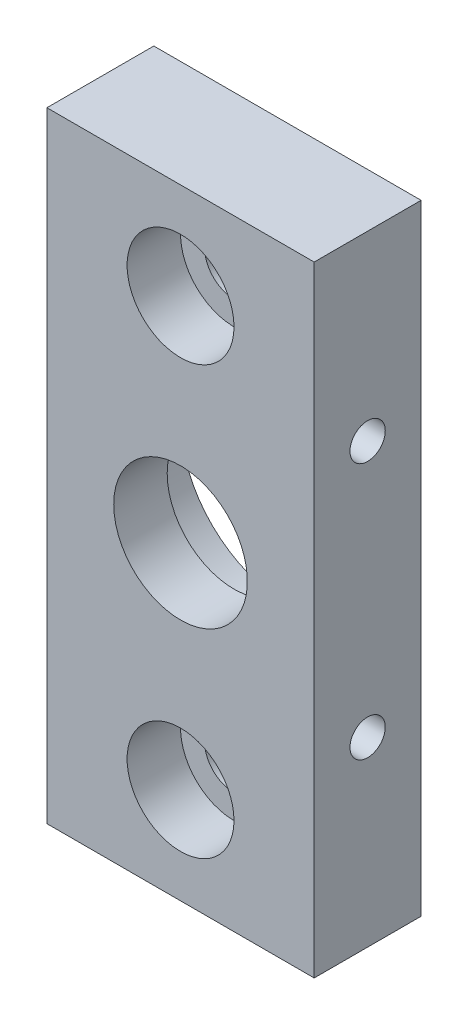
ISO-10303-21;
HEADER;
FILE_DESCRIPTION(('STEP AP214'),'2;1');
FILE_NAME('part.step','',(''),(''),'','','');
FILE_SCHEMA(('AUTOMOTIVE_DESIGN { 1 0 10303 214 1 1 1 1 }'));
ENDSEC;
DATA;
#1=APPLICATION_CONTEXT('core data for automotive mechanical design processes');
#2=APPLICATION_PROTOCOL_DEFINITION('international standard','automotive_design',2000,#1);
#3=PRODUCT_CONTEXT('',#1,'mechanical');
#4=PRODUCT('Part','Part','',(#3));
#5=PRODUCT_RELATED_PRODUCT_CATEGORY('part','',(#4));
#6=PRODUCT_DEFINITION_FORMATION('','',#4);
#7=PRODUCT_DEFINITION_CONTEXT('part definition',#1,'design');
#8=PRODUCT_DEFINITION('design','',#6,#7);
#9=PRODUCT_DEFINITION_SHAPE('','',#8);
#10=(LENGTH_UNIT() NAMED_UNIT(*) SI_UNIT(.MILLI.,.METRE.));
#11=(NAMED_UNIT(*) PLANE_ANGLE_UNIT() SI_UNIT($,.RADIAN.));
#12=(NAMED_UNIT(*) SI_UNIT($,.STERADIAN.) SOLID_ANGLE_UNIT());
#13=UNCERTAINTY_MEASURE_WITH_UNIT(LENGTH_MEASURE(1.E-05),#10,'distance_accuracy_value','');
#14=(GEOMETRIC_REPRESENTATION_CONTEXT(3) GLOBAL_UNCERTAINTY_ASSIGNED_CONTEXT((#13)) GLOBAL_UNIT_ASSIGNED_CONTEXT((#10,
#11,#12)) REPRESENTATION_CONTEXT('',''));
#15=CARTESIAN_POINT('',(0.,0.,0.));
#16=DIRECTION('',(0.,0.,1.));
#17=DIRECTION('',(1.,0.,0.));
#18=AXIS2_PLACEMENT_3D('',#15,#16,#17);
#19=CARTESIAN_POINT('',(12.5,-29.,10.0000000000001));
#20=DIRECTION('',(-1.,0.,0.));
#21=DIRECTION('',(0.,0.,1.));
#22=AXIS2_PLACEMENT_3D('',#19,#20,#21);
#23=PLANE('',#22);
#24=CARTESIAN_POINT('',(12.5,-12.,5.));
#25=DIRECTION('',(-1.,0.,0.));
#26=DIRECTION('',(0.,0.,1.));
#27=AXIS2_PLACEMENT_3D('',#24,#25,#26);
#28=CIRCLE('',#27,1.64999999999998);
#29=CARTESIAN_POINT('',(12.5,-12.,6.64999999999999));
#30=VERTEX_POINT('',#29);
#31=EDGE_CURVE('E156',#30,#30,#28,.T.);
#32=ORIENTED_EDGE('',*,*,#31,.T.);
#33=EDGE_LOOP('',(#32));
#34=FACE_BOUND('',#33,.T.);
#35=DIRECTION('',(0.,1.,0.));
#36=VECTOR('',#35,1.);
#37=CARTESIAN_POINT('',(12.5,-29.,0.));
#38=LINE('',#37,#36);
#39=CARTESIAN_POINT('',(12.5,-29.,0.));
#40=VERTEX_POINT('',#39);
#41=CARTESIAN_POINT('',(12.5,29.0000000000001,1.66533453693773E-13));
#42=VERTEX_POINT('',#41);
#43=EDGE_CURVE('E100',#40,#42,#38,.T.);
#44=ORIENTED_EDGE('',*,*,#43,.T.);
#45=DIRECTION('',(0.,0.,-1.));
#46=VECTOR('',#45,1.);
#47=CARTESIAN_POINT('',(12.5,29.0000000000001,10.0000000000001));
#48=LINE('',#47,#46);
#49=CARTESIAN_POINT('',(12.5,29.0000000000001,10.0000000000001));
#50=VERTEX_POINT('',#49);
#51=EDGE_CURVE('E11',#50,#42,#48,.T.);
#52=ORIENTED_EDGE('',*,*,#51,.F.);
#53=DIRECTION('',(0.,1.,0.));
#54=VECTOR('',#53,1.);
#55=CARTESIAN_POINT('',(12.5,-29.,10.0000000000001));
#56=LINE('',#55,#54);
#57=CARTESIAN_POINT('',(12.5,-29.,10.0000000000001));
#58=VERTEX_POINT('',#57);
#59=EDGE_CURVE('E88',#58,#50,#56,.T.);
#60=ORIENTED_EDGE('',*,*,#59,.F.);
#61=DIRECTION('',(0.,0.,-1.));
#62=VECTOR('',#61,1.);
#63=CARTESIAN_POINT('',(12.5,-29.,10.0000000000001));
#64=LINE('',#63,#62);
#65=EDGE_CURVE('E96',#58,#40,#64,.T.);
#66=ORIENTED_EDGE('',*,*,#65,.T.);
#67=EDGE_LOOP('',(#44,#52,#60,#66));
#68=FACE_BOUND('',#67,.T.);
#69=CARTESIAN_POINT('',(12.5,12.0000000000001,5.00000000000009));
#70=DIRECTION('',(1.,0.,0.));
#71=DIRECTION('',(0.,0.,-1.));
#72=AXIS2_PLACEMENT_3D('',#69,#70,#71);
#73=CIRCLE('',#72,1.64999999999999);
#74=CARTESIAN_POINT('',(12.5,12.0000000000001,3.3500000000001));
#75=VERTEX_POINT('',#74);
#76=EDGE_CURVE('E153',#75,#75,#73,.T.);
#77=ORIENTED_EDGE('',*,*,#76,.F.);
#78=EDGE_LOOP('',(#77));
#79=FACE_BOUND('',#78,.T.);
#80=ADVANCED_FACE('F36',(#34,#68,#79),#23,.F.);
#81=CARTESIAN_POINT('',(12.5,29.0000000000001,10.0000000000001));
#82=DIRECTION('',(0.,0.,-1.));
#83=DIRECTION('',(-1.,0.,0.));
#84=AXIS2_PLACEMENT_3D('',#81,#82,#83);
#85=PLANE('',#84);
#86=ORIENTED_EDGE('',*,*,#59,.T.);
#87=DIRECTION('',(-1.,0.,0.));
#88=VECTOR('',#87,1.);
#89=CARTESIAN_POINT('',(-12.5,29.,10.0000000000002));
#90=LINE('',#89,#88);
#91=CARTESIAN_POINT('',(-12.5,29.,10.0000000000002));
#92=VERTEX_POINT('',#91);
#93=EDGE_CURVE('E82',#50,#92,#90,.T.);
#94=ORIENTED_EDGE('',*,*,#93,.T.);
#95=DIRECTION('',(0.,-1.,0.));
#96=VECTOR('',#95,1.);
#97=CARTESIAN_POINT('',(-12.5,-29.,10.0000000000001));
#98=LINE('',#97,#96);
#99=CARTESIAN_POINT('',(-12.5,-29.,10.0000000000001));
#100=VERTEX_POINT('',#99);
#101=EDGE_CURVE('E86',#92,#100,#98,.T.);
#102=ORIENTED_EDGE('',*,*,#101,.T.);
#103=DIRECTION('',(1.,0.,0.));
#104=VECTOR('',#103,1.);
#105=CARTESIAN_POINT('',(-12.5,-29.,10.0000000000001));
#106=LINE('',#105,#104);
#107=EDGE_CURVE('E52',#100,#58,#106,.T.);
#108=ORIENTED_EDGE('',*,*,#107,.T.);
#109=EDGE_LOOP('',(#86,#94,#102,#108));
#110=FACE_BOUND('',#109,.T.);
#111=CARTESIAN_POINT('',(0.,0.,9.99999999999984));
#112=DIRECTION('',(0.,0.,-1.));
#113=DIRECTION('',(-1.,0.,0.));
#114=AXIS2_PLACEMENT_3D('',#111,#112,#113);
#115=CIRCLE('',#114,6.25);
#116=CARTESIAN_POINT('',(-6.25,0.,9.99999999999984));
#117=VERTEX_POINT('',#116);
#118=EDGE_CURVE('E118',#117,#117,#115,.T.);
#119=ORIENTED_EDGE('',*,*,#118,.T.);
#120=EDGE_LOOP('',(#119));
#121=FACE_BOUND('',#120,.T.);
#122=CARTESIAN_POINT('',(0.,-20.,9.99999999999998));
#123=DIRECTION('',(0.,0.,1.));
#124=DIRECTION('',(1.,0.,0.));
#125=AXIS2_PLACEMENT_3D('',#122,#123,#124);
#126=CIRCLE('',#125,4.99999999999999);
#127=CARTESIAN_POINT('',(5.,-20.,9.99999999999998));
#128=VERTEX_POINT('',#127);
#129=EDGE_CURVE('E135',#128,#128,#126,.T.);
#130=ORIENTED_EDGE('',*,*,#129,.F.);
#131=EDGE_LOOP('',(#130));
#132=FACE_BOUND('',#131,.T.);
#133=CARTESIAN_POINT('',(0.,20.,10.));
#134=DIRECTION('',(0.,0.,1.));
#135=DIRECTION('',(1.,0.,0.));
#136=AXIS2_PLACEMENT_3D('',#133,#134,#135);
#137=CIRCLE('',#136,4.99999999999999);
#138=CARTESIAN_POINT('',(5.,20.,10.));
#139=VERTEX_POINT('',#138);
#140=EDGE_CURVE('E147',#139,#139,#137,.T.);
#141=ORIENTED_EDGE('',*,*,#140,.F.);
#142=EDGE_LOOP('',(#141));
#143=FACE_BOUND('',#142,.T.);
#144=ADVANCED_FACE('F83',(#110,#121,#132,#143),#85,.F.);
#145=CARTESIAN_POINT('',(-12.5,29.,10.0000000000002));
#146=DIRECTION('',(0.,-1.,0.));
#147=DIRECTION('',(0.,0.,-1.));
#148=AXIS2_PLACEMENT_3D('',#145,#146,#147);
#149=PLANE('',#148);
#150=DIRECTION('',(-1.,0.,0.));
#151=VECTOR('',#150,1.);
#152=CARTESIAN_POINT('',(-12.5,29.,2.4980018054066E-13));
#153=LINE('',#152,#151);
#154=CARTESIAN_POINT('',(-12.5,29.,2.4980018054066E-13));
#155=VERTEX_POINT('',#154);
#156=EDGE_CURVE('E92',#42,#155,#153,.T.);
#157=ORIENTED_EDGE('',*,*,#156,.T.);
#158=DIRECTION('',(0.,0.,-1.));
#159=VECTOR('',#158,1.);
#160=CARTESIAN_POINT('',(-12.5,29.,10.0000000000002));
#161=LINE('',#160,#159);
#162=EDGE_CURVE('E44',#92,#155,#161,.T.);
#163=ORIENTED_EDGE('',*,*,#162,.F.);
#164=ORIENTED_EDGE('',*,*,#93,.F.);
#165=ORIENTED_EDGE('',*,*,#51,.T.);
#166=EDGE_LOOP('',(#157,#163,#164,#165));
#167=FACE_BOUND('',#166,.T.);
#168=ADVANCED_FACE('F91',(#167),#149,.F.);
#169=CARTESIAN_POINT('',(-12.5,-29.,10.0000000000001));
#170=DIRECTION('',(1.,0.,0.));
#171=DIRECTION('',(0.,0.,-1.));
#172=AXIS2_PLACEMENT_3D('',#169,#170,#171);
#173=PLANE('',#172);
#174=CARTESIAN_POINT('',(-12.5,-12.,4.99999999999992));
#175=DIRECTION('',(-1.,0.,0.));
#176=DIRECTION('',(0.,0.,1.));
#177=AXIS2_PLACEMENT_3D('',#174,#175,#176);
#178=CIRCLE('',#177,1.64999999999999);
#179=CARTESIAN_POINT('',(-12.5,-12.,6.64999999999991));
#180=VERTEX_POINT('',#179);
#181=EDGE_CURVE('E159',#180,#180,#178,.T.);
#182=ORIENTED_EDGE('',*,*,#181,.F.);
#183=EDGE_LOOP('',(#182));
#184=FACE_BOUND('',#183,.T.);
#185=CARTESIAN_POINT('',(-12.5,12.,5.));
#186=DIRECTION('',(1.,0.,0.));
#187=DIRECTION('',(0.,0.,-1.));
#188=AXIS2_PLACEMENT_3D('',#185,#186,#187);
#189=CIRCLE('',#188,1.64999999999998);
#190=CARTESIAN_POINT('',(-12.5,12.,3.35000000000002));
#191=VERTEX_POINT('',#190);
#192=EDGE_CURVE('E150',#191,#191,#189,.T.);
#193=ORIENTED_EDGE('',*,*,#192,.T.);
#194=EDGE_LOOP('',(#193));
#195=FACE_BOUND('',#194,.T.);
#196=DIRECTION('',(0.,-1.,0.));
#197=VECTOR('',#196,1.);
#198=CARTESIAN_POINT('',(-12.5,-29.0000000000001,0.));
#199=LINE('',#198,#197);
#200=CARTESIAN_POINT('',(-12.5,-29.0000000000001,0.));
#201=VERTEX_POINT('',#200);
#202=EDGE_CURVE('E69',#155,#201,#199,.T.);
#203=ORIENTED_EDGE('',*,*,#202,.T.);
#204=DIRECTION('',(0.,0.,-1.));
#205=VECTOR('',#204,1.);
#206=CARTESIAN_POINT('',(-12.5,-29.,10.0000000000001));
#207=LINE('',#206,#205);
#208=EDGE_CURVE('E93',#100,#201,#207,.T.);
#209=ORIENTED_EDGE('',*,*,#208,.F.);
#210=ORIENTED_EDGE('',*,*,#101,.F.);
#211=ORIENTED_EDGE('',*,*,#162,.T.);
#212=EDGE_LOOP('',(#203,#209,#210,#211));
#213=FACE_BOUND('',#212,.T.);
#214=ADVANCED_FACE('F94',(#184,#195,#213),#173,.F.);
#215=CARTESIAN_POINT('',(-12.5,-29.,10.0000000000001));
#216=DIRECTION('',(0.,1.,0.));
#217=DIRECTION('',(0.,0.,1.));
#218=AXIS2_PLACEMENT_3D('',#215,#216,#217);
#219=PLANE('',#218);
#220=DIRECTION('',(1.,0.,0.));
#221=VECTOR('',#220,1.);
#222=CARTESIAN_POINT('',(-12.5,-29.0000000000001,0.));
#223=LINE('',#222,#221);
#224=EDGE_CURVE('E75',#201,#40,#223,.T.);
#225=ORIENTED_EDGE('',*,*,#224,.T.);
#226=ORIENTED_EDGE('',*,*,#65,.F.);
#227=ORIENTED_EDGE('',*,*,#107,.F.);
#228=ORIENTED_EDGE('',*,*,#208,.T.);
#229=EDGE_LOOP('',(#225,#226,#227,#228));
#230=FACE_BOUND('',#229,.T.);
#231=ADVANCED_FACE('F108',(#230),#219,.F.);
#232=CARTESIAN_POINT('',(12.5,29.0000000000001,1.66533453693773E-13));
#233=DIRECTION('',(0.,0.,-1.));
#234=DIRECTION('',(-1.,0.,0.));
#235=AXIS2_PLACEMENT_3D('',#232,#233,#234);
#236=PLANE('',#235);
#237=CARTESIAN_POINT('',(0.,20.,1.66533453693773E-13));
#238=DIRECTION('',(0.,0.,1.));
#239=DIRECTION('',(1.,0.,0.));
#240=AXIS2_PLACEMENT_3D('',#237,#238,#239);
#241=CIRCLE('',#240,2.75);
#242=CARTESIAN_POINT('',(2.75,20.,1.6653390092717E-13));
#243=VERTEX_POINT('',#242);
#244=EDGE_CURVE('E138',#243,#243,#241,.T.);
#245=ORIENTED_EDGE('',*,*,#244,.T.);
#246=EDGE_LOOP('',(#245));
#247=FACE_BOUND('',#246,.T.);
#248=CARTESIAN_POINT('',(0.,-20.,0.));
#249=DIRECTION('',(0.,0.,1.));
#250=DIRECTION('',(1.,0.,0.));
#251=AXIS2_PLACEMENT_3D('',#248,#249,#250);
#252=CIRCLE('',#251,2.75);
#253=CARTESIAN_POINT('',(2.75,-20.,0.));
#254=VERTEX_POINT('',#253);
#255=EDGE_CURVE('E124',#254,#254,#252,.T.);
#256=ORIENTED_EDGE('',*,*,#255,.T.);
#257=EDGE_LOOP('',(#256));
#258=FACE_BOUND('',#257,.T.);
#259=CARTESIAN_POINT('',(0.,0.,0.));
#260=DIRECTION('',(0.,0.,-1.));
#261=DIRECTION('',(-1.,0.,0.));
#262=AXIS2_PLACEMENT_3D('',#259,#260,#261);
#263=CIRCLE('',#262,10.);
#264=CARTESIAN_POINT('',(-10.,0.,0.));
#265=VERTEX_POINT('',#264);
#266=EDGE_CURVE('E115',#265,#265,#263,.T.);
#267=ORIENTED_EDGE('',*,*,#266,.F.);
#268=EDGE_LOOP('',(#267));
#269=FACE_BOUND('',#268,.T.);
#270=ORIENTED_EDGE('',*,*,#43,.F.);
#271=ORIENTED_EDGE('',*,*,#224,.F.);
#272=ORIENTED_EDGE('',*,*,#202,.F.);
#273=ORIENTED_EDGE('',*,*,#156,.F.);
#274=EDGE_LOOP('',(#270,#271,#272,#273));
#275=FACE_BOUND('',#274,.T.);
#276=ADVANCED_FACE('F111',(#247,#258,#269,#275),#236,.T.);
#277=CARTESIAN_POINT('',(0.,0.,4.99999999999992));
#278=DIRECTION('',(0.,0.,-1.));
#279=DIRECTION('',(-1.,0.,0.));
#280=AXIS2_PLACEMENT_3D('',#277,#278,#279);
#281=CYLINDRICAL_SURFACE('',#280,10.);
#282=CARTESIAN_POINT('',(0.,0.,4.99999999999992));
#283=DIRECTION('',(0.,0.,-1.));
#284=DIRECTION('',(-1.,0.,0.));
#285=AXIS2_PLACEMENT_3D('',#282,#283,#284);
#286=CIRCLE('',#285,10.);
#287=CARTESIAN_POINT('',(-10.,0.,4.99999999999992));
#288=VERTEX_POINT('',#287);
#289=EDGE_CURVE('E103',#288,#288,#286,.T.);
#290=ORIENTED_EDGE('',*,*,#289,.F.);
#291=EDGE_LOOP('',(#290));
#292=FACE_BOUND('',#291,.T.);
#293=ORIENTED_EDGE('',*,*,#266,.T.);
#294=EDGE_LOOP('',(#293));
#295=FACE_BOUND('',#294,.T.);
#296=ADVANCED_FACE('F219',(#292,#295),#281,.F.);
#297=CARTESIAN_POINT('',(0.,0.,4.99999999999992));
#298=DIRECTION('',(0.,0.,-1.));
#299=DIRECTION('',(-1.,0.,0.));
#300=AXIS2_PLACEMENT_3D('',#297,#298,#299);
#301=PLANE('',#300);
#302=CARTESIAN_POINT('',(0.,0.,4.99999999999992));
#303=DIRECTION('',(0.,0.,-1.));
#304=DIRECTION('',(-1.,0.,0.));
#305=AXIS2_PLACEMENT_3D('',#302,#303,#304);
#306=CIRCLE('',#305,6.25);
#307=CARTESIAN_POINT('',(-6.25,0.,4.99999999999992));
#308=VERTEX_POINT('',#307);
#309=EDGE_CURVE('E121',#308,#308,#306,.T.);
#310=ORIENTED_EDGE('',*,*,#309,.F.);
#311=EDGE_LOOP('',(#310));
#312=FACE_BOUND('',#311,.T.);
#313=ORIENTED_EDGE('',*,*,#289,.T.);
#314=EDGE_LOOP('',(#313));
#315=FACE_BOUND('',#314,.T.);
#316=ADVANCED_FACE('F215',(#312,#315),#301,.T.);
#317=CARTESIAN_POINT('',(0.,0.,9.99999999999984));
#318=DIRECTION('',(0.,0.,-1.));
#319=DIRECTION('',(-1.,0.,0.));
#320=AXIS2_PLACEMENT_3D('',#317,#318,#319);
#321=CYLINDRICAL_SURFACE('',#320,6.25);
#322=ORIENTED_EDGE('',*,*,#118,.F.);
#323=EDGE_LOOP('',(#322));
#324=FACE_BOUND('',#323,.T.);
#325=ORIENTED_EDGE('',*,*,#309,.T.);
#326=EDGE_LOOP('',(#325));
#327=FACE_BOUND('',#326,.T.);
#328=ADVANCED_FACE('F211',(#324,#327),#321,.F.);
#329=CARTESIAN_POINT('',(0.,-20.,9.99999999999998));
#330=DIRECTION('',(0.,0.,1.));
#331=DIRECTION('',(1.,0.,0.));
#332=AXIS2_PLACEMENT_3D('',#329,#330,#331);
#333=CYLINDRICAL_SURFACE('',#332,2.75);
#334=ORIENTED_EDGE('',*,*,#255,.F.);
#335=EDGE_LOOP('',(#334));
#336=FACE_BOUND('',#335,.T.);
#337=CARTESIAN_POINT('',(0.,-20.,4.99999999999992));
#338=DIRECTION('',(0.,0.,1.));
#339=DIRECTION('',(1.,0.,0.));
#340=AXIS2_PLACEMENT_3D('',#337,#338,#339);
#341=CIRCLE('',#340,2.75);
#342=CARTESIAN_POINT('',(2.75,-20.,4.99999999999992));
#343=VERTEX_POINT('',#342);
#344=EDGE_CURVE('E129',#343,#343,#341,.T.);
#345=ORIENTED_EDGE('',*,*,#344,.T.);
#346=EDGE_LOOP('',(#345));
#347=FACE_BOUND('',#346,.T.);
#348=ADVANCED_FACE('F207',(#336,#347),#333,.F.);
#349=CARTESIAN_POINT('',(2.75,-20.,4.99999999999998));
#350=DIRECTION('',(0.,0.,-1.));
#351=DIRECTION('',(-1.,0.,0.));
#352=AXIS2_PLACEMENT_3D('',#349,#350,#351);
#353=PLANE('',#352);
#354=ORIENTED_EDGE('',*,*,#344,.F.);
#355=EDGE_LOOP('',(#354));
#356=FACE_BOUND('',#355,.T.);
#357=CARTESIAN_POINT('',(0.,-20.,4.99999999999992));
#358=DIRECTION('',(0.,0.,1.));
#359=DIRECTION('',(1.,0.,0.));
#360=AXIS2_PLACEMENT_3D('',#357,#358,#359);
#361=CIRCLE('',#360,5.);
#362=CARTESIAN_POINT('',(5.,-20.,4.99999999999992));
#363=VERTEX_POINT('',#362);
#364=EDGE_CURVE('E132',#363,#363,#361,.T.);
#365=ORIENTED_EDGE('',*,*,#364,.T.);
#366=EDGE_LOOP('',(#365));
#367=FACE_BOUND('',#366,.T.);
#368=ADVANCED_FACE('F203',(#356,#367),#353,.F.);
#369=CARTESIAN_POINT('',(0.,-20.,9.99999999999998));
#370=DIRECTION('',(0.,0.,1.));
#371=DIRECTION('',(1.,0.,0.));
#372=AXIS2_PLACEMENT_3D('',#369,#370,#371);
#373=CYLINDRICAL_SURFACE('',#372,5.);
#374=ORIENTED_EDGE('',*,*,#364,.F.);
#375=EDGE_LOOP('',(#374));
#376=FACE_BOUND('',#375,.T.);
#377=ORIENTED_EDGE('',*,*,#129,.T.);
#378=EDGE_LOOP('',(#377));
#379=FACE_BOUND('',#378,.T.);
#380=ADVANCED_FACE('F199',(#376,#379),#373,.F.);
#381=CARTESIAN_POINT('',(0.,20.,10.));
#382=DIRECTION('',(0.,0.,1.));
#383=DIRECTION('',(1.,0.,0.));
#384=AXIS2_PLACEMENT_3D('',#381,#382,#383);
#385=CYLINDRICAL_SURFACE('',#384,2.75);
#386=ORIENTED_EDGE('',*,*,#244,.F.);
#387=EDGE_LOOP('',(#386));
#388=FACE_BOUND('',#387,.T.);
#389=CARTESIAN_POINT('',(0.,20.,5.00000000000009));
#390=DIRECTION('',(0.,0.,1.));
#391=DIRECTION('',(1.,0.,0.));
#392=AXIS2_PLACEMENT_3D('',#389,#390,#391);
#393=CIRCLE('',#392,2.75000000000001);
#394=CARTESIAN_POINT('',(2.75000000000001,20.,5.00000000000009));
#395=VERTEX_POINT('',#394);
#396=EDGE_CURVE('E141',#395,#395,#393,.T.);
#397=ORIENTED_EDGE('',*,*,#396,.T.);
#398=EDGE_LOOP('',(#397));
#399=FACE_BOUND('',#398,.T.);
#400=ADVANCED_FACE('F195',(#388,#399),#385,.F.);
#401=CARTESIAN_POINT('',(2.75000000000002,20.,5.00000000000009));
#402=DIRECTION('',(0.,0.,-1.));
#403=DIRECTION('',(-1.,0.,0.));
#404=AXIS2_PLACEMENT_3D('',#401,#402,#403);
#405=PLANE('',#404);
#406=ORIENTED_EDGE('',*,*,#396,.F.);
#407=EDGE_LOOP('',(#406));
#408=FACE_BOUND('',#407,.T.);
#409=CARTESIAN_POINT('',(0.,20.,5.00000000000009));
#410=DIRECTION('',(0.,0.,1.));
#411=DIRECTION('',(1.,0.,0.));
#412=AXIS2_PLACEMENT_3D('',#409,#410,#411);
#413=CIRCLE('',#412,4.99999999999999);
#414=CARTESIAN_POINT('',(5.,20.,5.00000000000009));
#415=VERTEX_POINT('',#414);
#416=EDGE_CURVE('E144',#415,#415,#413,.T.);
#417=ORIENTED_EDGE('',*,*,#416,.T.);
#418=EDGE_LOOP('',(#417));
#419=FACE_BOUND('',#418,.T.);
#420=ADVANCED_FACE('F191',(#408,#419),#405,.F.);
#421=CARTESIAN_POINT('',(0.,20.,10.));
#422=DIRECTION('',(0.,0.,1.));
#423=DIRECTION('',(1.,0.,0.));
#424=AXIS2_PLACEMENT_3D('',#421,#422,#423);
#425=CYLINDRICAL_SURFACE('',#424,4.99999999999999);
#426=ORIENTED_EDGE('',*,*,#416,.F.);
#427=EDGE_LOOP('',(#426));
#428=FACE_BOUND('',#427,.T.);
#429=ORIENTED_EDGE('',*,*,#140,.T.);
#430=EDGE_LOOP('',(#429));
#431=FACE_BOUND('',#430,.T.);
#432=ADVANCED_FACE('F173',(#428,#431),#425,.F.);
#433=CARTESIAN_POINT('',(12.5,12.0000000000001,5.00000000000009));
#434=DIRECTION('',(1.,0.,0.));
#435=DIRECTION('',(0.,0.,-1.));
#436=AXIS2_PLACEMENT_3D('',#433,#434,#435);
#437=CYLINDRICAL_SURFACE('',#436,1.64999999999999);
#438=ORIENTED_EDGE('',*,*,#192,.F.);
#439=EDGE_LOOP('',(#438));
#440=FACE_BOUND('',#439,.T.);
#441=ORIENTED_EDGE('',*,*,#76,.T.);
#442=EDGE_LOOP('',(#441));
#443=FACE_BOUND('',#442,.T.);
#444=ADVANCED_FACE('F170',(#440,#443),#437,.F.);
#445=CARTESIAN_POINT('',(-12.5,-12.,4.99999999999992));
#446=DIRECTION('',(-1.,0.,0.));
#447=DIRECTION('',(0.,0.,1.));
#448=AXIS2_PLACEMENT_3D('',#445,#446,#447);
#449=CYLINDRICAL_SURFACE('',#448,1.64999999999999);
#450=ORIENTED_EDGE('',*,*,#31,.F.);
#451=EDGE_LOOP('',(#450));
#452=FACE_BOUND('',#451,.T.);
#453=ORIENTED_EDGE('',*,*,#181,.T.);
#454=EDGE_LOOP('',(#453));
#455=FACE_BOUND('',#454,.T.);
#456=ADVANCED_FACE('F163',(#452,#455),#449,.F.);
#457=CLOSED_SHELL('',(#80,#144,#168,#214,#231,#276,#296,#316,#328,#348,#368,#380,#400,#420,#432,
#444,#456));
#458=MANIFOLD_SOLID_BREP('B2',#457);
#459=ADVANCED_BREP_SHAPE_REPRESENTATION('',(#18,#458),#14);
#460=SHAPE_DEFINITION_REPRESENTATION(#9,#459);
ENDSEC;
END-ISO-10303-21;
